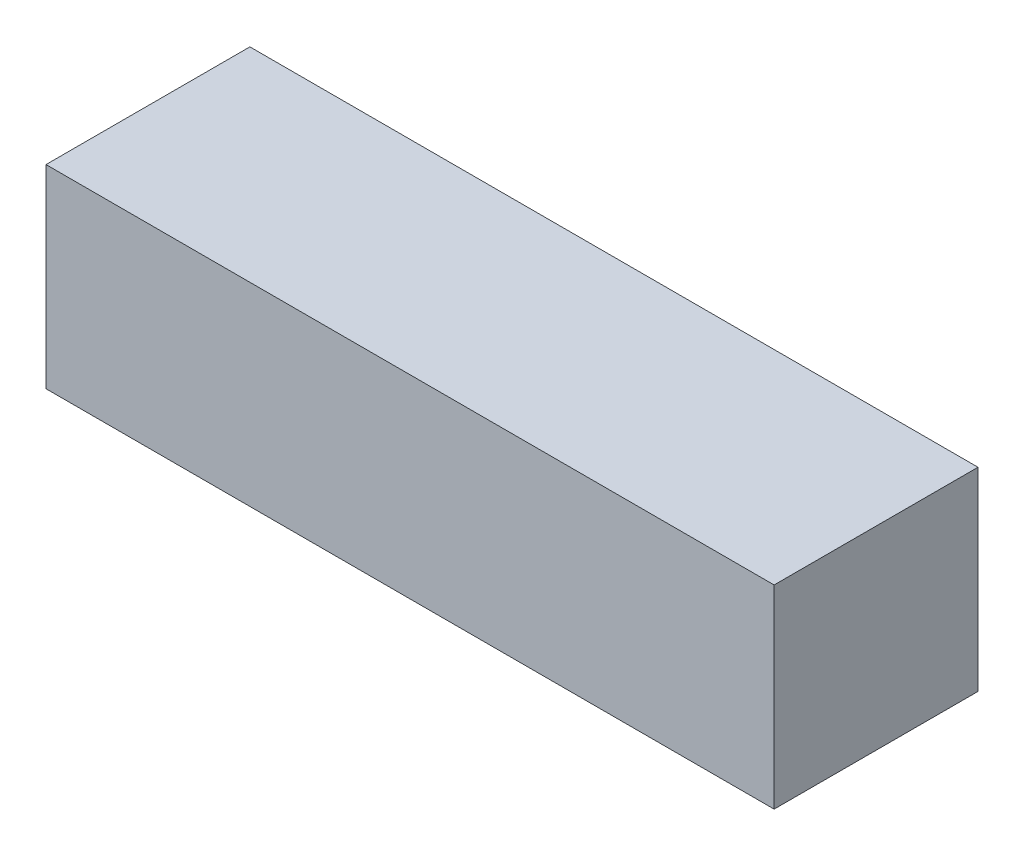
ISO-10303-21;
HEADER;
FILE_DESCRIPTION(('STEP AP214'),'2;1');
FILE_NAME('part.step','',(''),(''),'','','');
FILE_SCHEMA(('AUTOMOTIVE_DESIGN { 1 0 10303 214 1 1 1 1 }'));
ENDSEC;
DATA;
#1=APPLICATION_CONTEXT('core data for automotive mechanical design processes');
#2=APPLICATION_PROTOCOL_DEFINITION('international standard','automotive_design',2000,#1);
#3=PRODUCT_CONTEXT('',#1,'mechanical');
#4=PRODUCT('Part','Part','',(#3));
#5=PRODUCT_RELATED_PRODUCT_CATEGORY('part','',(#4));
#6=PRODUCT_DEFINITION_FORMATION('','',#4);
#7=PRODUCT_DEFINITION_CONTEXT('part definition',#1,'design');
#8=PRODUCT_DEFINITION('design','',#6,#7);
#9=PRODUCT_DEFINITION_SHAPE('','',#8);
#10=(LENGTH_UNIT() NAMED_UNIT(*) SI_UNIT(.MILLI.,.METRE.));
#11=(NAMED_UNIT(*) PLANE_ANGLE_UNIT() SI_UNIT($,.RADIAN.));
#12=(NAMED_UNIT(*) SI_UNIT($,.STERADIAN.) SOLID_ANGLE_UNIT());
#13=UNCERTAINTY_MEASURE_WITH_UNIT(LENGTH_MEASURE(1.E-05),#10,'distance_accuracy_value','');
#14=(GEOMETRIC_REPRESENTATION_CONTEXT(3) GLOBAL_UNCERTAINTY_ASSIGNED_CONTEXT((#13)) GLOBAL_UNIT_ASSIGNED_CONTEXT((#10,
#11,#12)) REPRESENTATION_CONTEXT('',''));
#15=CARTESIAN_POINT('',(0.,0.,0.));
#16=DIRECTION('',(0.,0.,1.));
#17=DIRECTION('',(1.,0.,0.));
#18=AXIS2_PLACEMENT_3D('',#15,#16,#17);
#19=CARTESIAN_POINT('',(-1.905,-0.508,0.));
#20=DIRECTION('',(0.,1.,0.));
#21=DIRECTION('',(0.,0.,1.));
#22=AXIS2_PLACEMENT_3D('',#19,#20,#21);
#23=PLANE('',#22);
#24=DIRECTION('',(0.,0.,1.));
#25=VECTOR('',#24,1.);
#26=CARTESIAN_POINT('',(1.905,-0.508,0.));
#27=LINE('',#26,#25);
#28=CARTESIAN_POINT('',(1.905,-0.508,0.));
#29=VERTEX_POINT('',#28);
#30=CARTESIAN_POINT('',(1.905,-0.508,1.0668));
#31=VERTEX_POINT('',#30);
#32=EDGE_CURVE('E19',#29,#31,#27,.T.);
#33=ORIENTED_EDGE('',*,*,#32,.T.);
#34=DIRECTION('',(-1.,0.,0.));
#35=VECTOR('',#34,1.);
#36=CARTESIAN_POINT('',(1.905,-0.508,1.0668));
#37=LINE('',#36,#35);
#38=CARTESIAN_POINT('',(-1.905,-0.508,1.0668));
#39=VERTEX_POINT('',#38);
#40=EDGE_CURVE('E54',#31,#39,#37,.T.);
#41=ORIENTED_EDGE('',*,*,#40,.T.);
#42=DIRECTION('',(0.,0.,-1.));
#43=VECTOR('',#42,1.);
#44=CARTESIAN_POINT('',(-1.905,-0.508,0.));
#45=LINE('',#44,#43);
#46=CARTESIAN_POINT('',(-1.905,-0.508,0.));
#47=VERTEX_POINT('',#46);
#48=EDGE_CURVE('E73',#39,#47,#45,.T.);
#49=ORIENTED_EDGE('',*,*,#48,.T.);
#50=DIRECTION('',(-1.,0.,0.));
#51=VECTOR('',#50,1.);
#52=CARTESIAN_POINT('',(1.905,-0.508,0.));
#53=LINE('',#52,#51);
#54=EDGE_CURVE('E65',#29,#47,#53,.T.);
#55=ORIENTED_EDGE('',*,*,#54,.F.);
#56=EDGE_LOOP('',(#33,#41,#49,#55));
#57=FACE_BOUND('',#56,.T.);
#58=ADVANCED_FACE('F16',(#57),#23,.F.);
#59=CARTESIAN_POINT('',(1.905,-0.508,0.));
#60=DIRECTION('',(-1.,0.,0.));
#61=DIRECTION('',(0.,0.,1.));
#62=AXIS2_PLACEMENT_3D('',#59,#60,#61);
#63=PLANE('',#62);
#64=DIRECTION('',(0.,0.,-1.));
#65=VECTOR('',#64,1.);
#66=CARTESIAN_POINT('',(1.905,0.508,0.));
#67=LINE('',#66,#65);
#68=CARTESIAN_POINT('',(1.905,0.508,0.));
#69=VERTEX_POINT('',#68);
#70=CARTESIAN_POINT('',(1.905,0.508,1.0668));
#71=VERTEX_POINT('',#70);
#72=EDGE_CURVE('E71',#69,#71,#67,.F.);
#73=ORIENTED_EDGE('',*,*,#72,.T.);
#74=DIRECTION('',(0.,1.,0.));
#75=VECTOR('',#74,1.);
#76=CARTESIAN_POINT('',(1.905,-0.508,1.0668));
#77=LINE('',#76,#75);
#78=EDGE_CURVE('E61',#71,#31,#77,.F.);
#79=ORIENTED_EDGE('',*,*,#78,.T.);
#80=ORIENTED_EDGE('',*,*,#32,.F.);
#81=DIRECTION('',(0.,1.,0.));
#82=VECTOR('',#81,1.);
#83=CARTESIAN_POINT('',(1.905,-0.508,0.));
#84=LINE('',#83,#82);
#85=EDGE_CURVE('E79',#69,#29,#84,.F.);
#86=ORIENTED_EDGE('',*,*,#85,.F.);
#87=EDGE_LOOP('',(#73,#79,#80,#86));
#88=FACE_BOUND('',#87,.T.);
#89=ADVANCED_FACE('F70',(#88),#63,.F.);
#90=CARTESIAN_POINT('',(1.905,-0.508,1.0668));
#91=DIRECTION('',(0.,0.,-1.));
#92=DIRECTION('',(-1.,0.,0.));
#93=AXIS2_PLACEMENT_3D('',#90,#91,#92);
#94=PLANE('',#93);
#95=DIRECTION('',(1.,0.,0.));
#96=VECTOR('',#95,1.);
#97=CARTESIAN_POINT('',(1.905,0.508,1.0668));
#98=LINE('',#97,#96);
#99=CARTESIAN_POINT('',(-1.905,0.508,1.0668));
#100=VERTEX_POINT('',#99);
#101=EDGE_CURVE('E82',#71,#100,#98,.F.);
#102=ORIENTED_EDGE('',*,*,#101,.T.);
#103=DIRECTION('',(0.,1.,0.));
#104=VECTOR('',#103,1.);
#105=CARTESIAN_POINT('',(-1.905,0.508,1.0668));
#106=LINE('',#105,#104);
#107=EDGE_CURVE('E63',#100,#39,#106,.F.);
#108=ORIENTED_EDGE('',*,*,#107,.T.);
#109=ORIENTED_EDGE('',*,*,#40,.F.);
#110=ORIENTED_EDGE('',*,*,#78,.F.);
#111=EDGE_LOOP('',(#102,#108,#109,#110));
#112=FACE_BOUND('',#111,.T.);
#113=ADVANCED_FACE('F59',(#112),#94,.F.);
#114=CARTESIAN_POINT('',(-1.905,0.508,0.));
#115=DIRECTION('',(1.,0.,0.));
#116=DIRECTION('',(0.,0.,-1.));
#117=AXIS2_PLACEMENT_3D('',#114,#115,#116);
#118=PLANE('',#117);
#119=ORIENTED_EDGE('',*,*,#48,.F.);
#120=ORIENTED_EDGE('',*,*,#107,.F.);
#121=DIRECTION('',(0.,0.,-1.));
#122=VECTOR('',#121,1.);
#123=CARTESIAN_POINT('',(-1.905,0.508,0.));
#124=LINE('',#123,#122);
#125=CARTESIAN_POINT('',(-1.905,0.508,0.));
#126=VERTEX_POINT('',#125);
#127=EDGE_CURVE('E25',#100,#126,#124,.T.);
#128=ORIENTED_EDGE('',*,*,#127,.T.);
#129=DIRECTION('',(0.,1.,0.));
#130=VECTOR('',#129,1.);
#131=CARTESIAN_POINT('',(-1.905,-0.508,0.));
#132=LINE('',#131,#130);
#133=EDGE_CURVE('E33',#47,#126,#132,.T.);
#134=ORIENTED_EDGE('',*,*,#133,.F.);
#135=EDGE_LOOP('',(#119,#120,#128,#134));
#136=FACE_BOUND('',#135,.T.);
#137=ADVANCED_FACE('F87',(#136),#118,.F.);
#138=CARTESIAN_POINT('',(1.905,-0.508,0.));
#139=DIRECTION('',(0.,0.,-1.));
#140=DIRECTION('',(-1.,0.,0.));
#141=AXIS2_PLACEMENT_3D('',#138,#139,#140);
#142=PLANE('',#141);
#143=DIRECTION('',(1.,0.,0.));
#144=VECTOR('',#143,1.);
#145=CARTESIAN_POINT('',(1.905,0.508,0.));
#146=LINE('',#145,#144);
#147=EDGE_CURVE('E11',#126,#69,#146,.T.);
#148=ORIENTED_EDGE('',*,*,#147,.T.);
#149=ORIENTED_EDGE('',*,*,#85,.T.);
#150=ORIENTED_EDGE('',*,*,#54,.T.);
#151=ORIENTED_EDGE('',*,*,#133,.T.);
#152=EDGE_LOOP('',(#148,#149,#150,#151));
#153=FACE_BOUND('',#152,.T.);
#154=ADVANCED_FACE('F90',(#153),#142,.T.);
#155=CARTESIAN_POINT('',(1.905,0.508,0.));
#156=DIRECTION('',(0.,-1.,0.));
#157=DIRECTION('',(0.,0.,-1.));
#158=AXIS2_PLACEMENT_3D('',#155,#156,#157);
#159=PLANE('',#158);
#160=ORIENTED_EDGE('',*,*,#127,.F.);
#161=ORIENTED_EDGE('',*,*,#101,.F.);
#162=ORIENTED_EDGE('',*,*,#72,.F.);
#163=ORIENTED_EDGE('',*,*,#147,.F.);
#164=EDGE_LOOP('',(#160,#161,#162,#163));
#165=FACE_BOUND('',#164,.T.);
#166=ADVANCED_FACE('F89',(#165),#159,.F.);
#167=CLOSED_SHELL('',(#58,#89,#113,#137,#154,#166));
#168=MANIFOLD_SOLID_BREP('B1',#167);
#169=ADVANCED_BREP_SHAPE_REPRESENTATION('',(#18,#168),#14);
#170=SHAPE_DEFINITION_REPRESENTATION(#9,#169);
ENDSEC;
END-ISO-10303-21;
